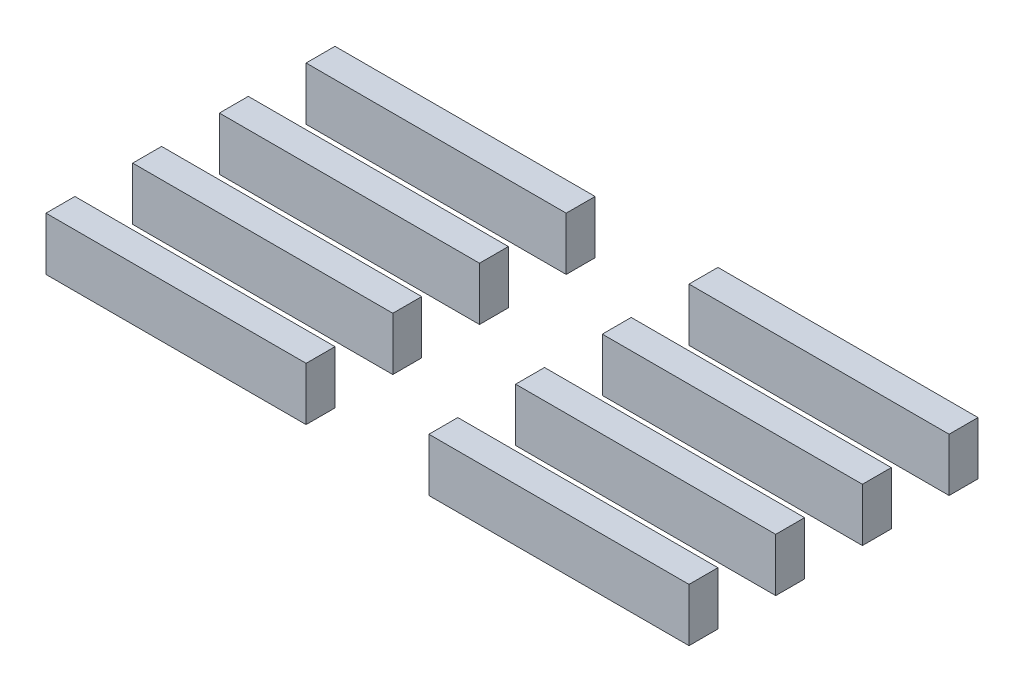
ISO-10303-21;
HEADER;
FILE_DESCRIPTION(('STEP AP214'),'2;1');
FILE_NAME('part.step','',(''),(''),'','','');
FILE_SCHEMA(('AUTOMOTIVE_DESIGN { 1 0 10303 214 1 1 1 1 }'));
ENDSEC;
DATA;
#1=APPLICATION_CONTEXT('core data for automotive mechanical design processes');
#2=APPLICATION_PROTOCOL_DEFINITION('international standard','automotive_design',2000,#1);
#3=PRODUCT_CONTEXT('',#1,'mechanical');
#4=PRODUCT('Part','Part','',(#3));
#5=PRODUCT_RELATED_PRODUCT_CATEGORY('part','',(#4));
#6=PRODUCT_DEFINITION_FORMATION('','',#4);
#7=PRODUCT_DEFINITION_CONTEXT('part definition',#1,'design');
#8=PRODUCT_DEFINITION('design','',#6,#7);
#9=PRODUCT_DEFINITION_SHAPE('','',#8);
#10=(LENGTH_UNIT() NAMED_UNIT(*) SI_UNIT(.MILLI.,.METRE.));
#11=(NAMED_UNIT(*) PLANE_ANGLE_UNIT() SI_UNIT($,.RADIAN.));
#12=(NAMED_UNIT(*) SI_UNIT($,.STERADIAN.) SOLID_ANGLE_UNIT());
#13=UNCERTAINTY_MEASURE_WITH_UNIT(LENGTH_MEASURE(1.E-05),#10,'distance_accuracy_value','');
#14=(GEOMETRIC_REPRESENTATION_CONTEXT(3) GLOBAL_UNCERTAINTY_ASSIGNED_CONTEXT((#13)) GLOBAL_UNIT_ASSIGNED_CONTEXT((#10,
#11,#12)) REPRESENTATION_CONTEXT('',''));
#15=CARTESIAN_POINT('',(0.,0.,0.));
#16=DIRECTION('',(0.,0.,1.));
#17=DIRECTION('',(1.,0.,0.));
#18=AXIS2_PLACEMENT_3D('',#15,#16,#17);
#19=CARTESIAN_POINT('',(59.4999999999999,7.35,-42.5));
#20=DIRECTION('',(1.,0.,0.));
#21=DIRECTION('',(0.,0.,-1.));
#22=AXIS2_PLACEMENT_3D('',#19,#20,#21);
#23=PLANE('',#22);
#24=DIRECTION('',(0.,0.,1.));
#25=VECTOR('',#24,1.);
#26=CARTESIAN_POINT('',(59.4999999999999,0.,-42.5));
#27=LINE('',#26,#25);
#28=CARTESIAN_POINT('',(59.4999999999999,0.,-46.5));
#29=VERTEX_POINT('',#28);
#30=CARTESIAN_POINT('',(59.4999999999999,0.,-42.5));
#31=VERTEX_POINT('',#30);
#32=EDGE_CURVE('E107',#29,#31,#27,.T.);
#33=ORIENTED_EDGE('',*,*,#32,.T.);
#34=DIRECTION('',(0.,-1.,0.));
#35=VECTOR('',#34,1.);
#36=CARTESIAN_POINT('',(59.4999999999999,7.35,-42.5));
#37=LINE('',#36,#35);
#38=CARTESIAN_POINT('',(59.4999999999999,7.35,-42.5));
#39=VERTEX_POINT('',#38);
#40=EDGE_CURVE('E12',#39,#31,#37,.T.);
#41=ORIENTED_EDGE('',*,*,#40,.F.);
#42=DIRECTION('',(0.,0.,1.));
#43=VECTOR('',#42,1.);
#44=CARTESIAN_POINT('',(59.4999999999999,7.35,-42.5));
#45=LINE('',#44,#43);
#46=CARTESIAN_POINT('',(59.4999999999999,7.35,-46.5));
#47=VERTEX_POINT('',#46);
#48=EDGE_CURVE('E95',#47,#39,#45,.T.);
#49=ORIENTED_EDGE('',*,*,#48,.F.);
#50=DIRECTION('',(0.,-1.,0.));
#51=VECTOR('',#50,1.);
#52=CARTESIAN_POINT('',(59.4999999999999,7.35,-46.5));
#53=LINE('',#52,#51);
#54=EDGE_CURVE('E103',#47,#29,#53,.T.);
#55=ORIENTED_EDGE('',*,*,#54,.T.);
#56=EDGE_LOOP('',(#33,#41,#49,#55));
#57=FACE_BOUND('',#56,.T.);
#58=ADVANCED_FACE('F44',(#57),#23,.F.);
#59=CARTESIAN_POINT('',(59.4999999999999,7.35,-42.5));
#60=DIRECTION('',(0.,0.,-1.));
#61=DIRECTION('',(-1.,0.,0.));
#62=AXIS2_PLACEMENT_3D('',#59,#60,#61);
#63=PLANE('',#62);
#64=DIRECTION('',(1.,0.,0.));
#65=VECTOR('',#64,1.);
#66=CARTESIAN_POINT('',(59.4999999999999,0.,-42.5));
#67=LINE('',#66,#65);
#68=CARTESIAN_POINT('',(95.4999999999999,0.,-42.5));
#69=VERTEX_POINT('',#68);
#70=EDGE_CURVE('E99',#31,#69,#67,.T.);
#71=ORIENTED_EDGE('',*,*,#70,.T.);
#72=DIRECTION('',(0.,-1.,0.));
#73=VECTOR('',#72,1.);
#74=CARTESIAN_POINT('',(95.4999999999999,7.35,-42.5));
#75=LINE('',#74,#73);
#76=CARTESIAN_POINT('',(95.4999999999999,7.35,-42.5));
#77=VERTEX_POINT('',#76);
#78=EDGE_CURVE('E52',#77,#69,#75,.T.);
#79=ORIENTED_EDGE('',*,*,#78,.F.);
#80=DIRECTION('',(1.,0.,0.));
#81=VECTOR('',#80,1.);
#82=CARTESIAN_POINT('',(59.4999999999999,7.35,-42.5));
#83=LINE('',#82,#81);
#84=EDGE_CURVE('E90',#39,#77,#83,.T.);
#85=ORIENTED_EDGE('',*,*,#84,.F.);
#86=ORIENTED_EDGE('',*,*,#40,.T.);
#87=EDGE_LOOP('',(#71,#79,#85,#86));
#88=FACE_BOUND('',#87,.T.);
#89=ADVANCED_FACE('F98',(#88),#63,.F.);
#90=CARTESIAN_POINT('',(95.4999999999999,7.35,-42.5));
#91=DIRECTION('',(-1.,0.,0.));
#92=DIRECTION('',(0.,0.,1.));
#93=AXIS2_PLACEMENT_3D('',#90,#91,#92);
#94=PLANE('',#93);
#95=DIRECTION('',(0.,0.,-1.));
#96=VECTOR('',#95,1.);
#97=CARTESIAN_POINT('',(95.4999999999999,0.,-42.5));
#98=LINE('',#97,#96);
#99=CARTESIAN_POINT('',(95.4999999999999,0.,-46.5));
#100=VERTEX_POINT('',#99);
#101=EDGE_CURVE('E77',#69,#100,#98,.T.);
#102=ORIENTED_EDGE('',*,*,#101,.T.);
#103=DIRECTION('',(0.,-1.,0.));
#104=VECTOR('',#103,1.);
#105=CARTESIAN_POINT('',(95.4999999999999,7.35,-46.5));
#106=LINE('',#105,#104);
#107=CARTESIAN_POINT('',(95.4999999999999,7.35,-46.5));
#108=VERTEX_POINT('',#107);
#109=EDGE_CURVE('E100',#108,#100,#106,.T.);
#110=ORIENTED_EDGE('',*,*,#109,.F.);
#111=DIRECTION('',(0.,0.,-1.));
#112=VECTOR('',#111,1.);
#113=CARTESIAN_POINT('',(95.4999999999999,7.35,-42.5));
#114=LINE('',#113,#112);
#115=EDGE_CURVE('E93',#77,#108,#114,.T.);
#116=ORIENTED_EDGE('',*,*,#115,.F.);
#117=ORIENTED_EDGE('',*,*,#78,.T.);
#118=EDGE_LOOP('',(#102,#110,#116,#117));
#119=FACE_BOUND('',#118,.T.);
#120=ADVANCED_FACE('F101',(#119),#94,.F.);
#121=CARTESIAN_POINT('',(59.4999999999999,7.35,-46.5));
#122=DIRECTION('',(0.,0.,1.));
#123=DIRECTION('',(1.,0.,0.));
#124=AXIS2_PLACEMENT_3D('',#121,#122,#123);
#125=PLANE('',#124);
#126=DIRECTION('',(-1.,0.,0.));
#127=VECTOR('',#126,1.);
#128=CARTESIAN_POINT('',(59.4999999999999,0.,-46.5));
#129=LINE('',#128,#127);
#130=EDGE_CURVE('E83',#100,#29,#129,.T.);
#131=ORIENTED_EDGE('',*,*,#130,.T.);
#132=ORIENTED_EDGE('',*,*,#54,.F.);
#133=DIRECTION('',(-1.,0.,0.));
#134=VECTOR('',#133,1.);
#135=CARTESIAN_POINT('',(59.4999999999999,7.35,-46.5));
#136=LINE('',#135,#134);
#137=EDGE_CURVE('E60',#108,#47,#136,.T.);
#138=ORIENTED_EDGE('',*,*,#137,.F.);
#139=ORIENTED_EDGE('',*,*,#109,.T.);
#140=EDGE_LOOP('',(#131,#132,#138,#139));
#141=FACE_BOUND('',#140,.T.);
#142=ADVANCED_FACE('F114',(#141),#125,.F.);
#143=CARTESIAN_POINT('',(59.4999999999999,7.35,-46.5));
#144=DIRECTION('',(0.,-1.,0.));
#145=DIRECTION('',(0.,0.,-1.));
#146=AXIS2_PLACEMENT_3D('',#143,#144,#145);
#147=PLANE('',#146);
#148=ORIENTED_EDGE('',*,*,#48,.T.);
#149=ORIENTED_EDGE('',*,*,#84,.T.);
#150=ORIENTED_EDGE('',*,*,#115,.T.);
#151=ORIENTED_EDGE('',*,*,#137,.T.);
#152=EDGE_LOOP('',(#148,#149,#150,#151));
#153=FACE_BOUND('',#152,.T.);
#154=ADVANCED_FACE('F91',(#153),#147,.F.);
#155=CARTESIAN_POINT('',(59.4999999999999,0.,-46.5));
#156=DIRECTION('',(0.,-1.,0.));
#157=DIRECTION('',(0.,0.,-1.));
#158=AXIS2_PLACEMENT_3D('',#155,#156,#157);
#159=PLANE('',#158);
#160=ORIENTED_EDGE('',*,*,#32,.F.);
#161=ORIENTED_EDGE('',*,*,#130,.F.);
#162=ORIENTED_EDGE('',*,*,#101,.F.);
#163=ORIENTED_EDGE('',*,*,#70,.F.);
#164=EDGE_LOOP('',(#160,#161,#162,#163));
#165=FACE_BOUND('',#164,.T.);
#166=ADVANCED_FACE('F117',(#165),#159,.T.);
#167=CLOSED_SHELL('',(#58,#89,#120,#142,#154,#166));
#168=MANIFOLD_SOLID_BREP('B2',#167);
#169=CARTESIAN_POINT('',(59.4999999999999,7.35,-30.5));
#170=DIRECTION('',(1.,0.,0.));
#171=DIRECTION('',(0.,0.,-1.));
#172=AXIS2_PLACEMENT_3D('',#169,#170,#171);
#173=PLANE('',#172);
#174=DIRECTION('',(0.,0.,1.));
#175=VECTOR('',#174,1.);
#176=CARTESIAN_POINT('',(59.4999999999999,0.,-30.5));
#177=LINE('',#176,#175);
#178=CARTESIAN_POINT('',(59.4999999999999,0.,-34.5));
#179=VERTEX_POINT('',#178);
#180=CARTESIAN_POINT('',(59.4999999999999,0.,-30.5));
#181=VERTEX_POINT('',#180);
#182=EDGE_CURVE('E241',#179,#181,#177,.T.);
#183=ORIENTED_EDGE('',*,*,#182,.T.);
#184=DIRECTION('',(0.,-1.,0.));
#185=VECTOR('',#184,1.);
#186=CARTESIAN_POINT('',(59.4999999999999,7.35,-30.5));
#187=LINE('',#186,#185);
#188=CARTESIAN_POINT('',(59.4999999999999,7.35,-30.5));
#189=VERTEX_POINT('',#188);
#190=EDGE_CURVE('E42',#189,#181,#187,.T.);
#191=ORIENTED_EDGE('',*,*,#190,.F.);
#192=DIRECTION('',(0.,0.,1.));
#193=VECTOR('',#192,1.);
#194=CARTESIAN_POINT('',(59.4999999999999,7.35,-30.5));
#195=LINE('',#194,#193);
#196=CARTESIAN_POINT('',(59.4999999999999,7.35,-34.5));
#197=VERTEX_POINT('',#196);
#198=EDGE_CURVE('E229',#197,#189,#195,.T.);
#199=ORIENTED_EDGE('',*,*,#198,.F.);
#200=DIRECTION('',(0.,-1.,0.));
#201=VECTOR('',#200,1.);
#202=CARTESIAN_POINT('',(59.4999999999999,7.35,-34.5));
#203=LINE('',#202,#201);
#204=EDGE_CURVE('E237',#197,#179,#203,.T.);
#205=ORIENTED_EDGE('',*,*,#204,.T.);
#206=EDGE_LOOP('',(#183,#191,#199,#205));
#207=FACE_BOUND('',#206,.T.);
#208=ADVANCED_FACE('F178',(#207),#173,.F.);
#209=CARTESIAN_POINT('',(59.4999999999999,7.35,-30.5));
#210=DIRECTION('',(0.,0.,-1.));
#211=DIRECTION('',(-1.,0.,0.));
#212=AXIS2_PLACEMENT_3D('',#209,#210,#211);
#213=PLANE('',#212);
#214=DIRECTION('',(1.,0.,0.));
#215=VECTOR('',#214,1.);
#216=CARTESIAN_POINT('',(59.4999999999999,0.,-30.5));
#217=LINE('',#216,#215);
#218=CARTESIAN_POINT('',(95.4999999999999,0.,-30.5));
#219=VERTEX_POINT('',#218);
#220=EDGE_CURVE('E233',#181,#219,#217,.T.);
#221=ORIENTED_EDGE('',*,*,#220,.T.);
#222=DIRECTION('',(0.,-1.,0.));
#223=VECTOR('',#222,1.);
#224=CARTESIAN_POINT('',(95.4999999999999,7.35,-30.5));
#225=LINE('',#224,#223);
#226=CARTESIAN_POINT('',(95.4999999999999,7.35,-30.5));
#227=VERTEX_POINT('',#226);
#228=EDGE_CURVE('E186',#227,#219,#225,.T.);
#229=ORIENTED_EDGE('',*,*,#228,.F.);
#230=DIRECTION('',(1.,0.,0.));
#231=VECTOR('',#230,1.);
#232=CARTESIAN_POINT('',(59.4999999999999,7.35,-30.5));
#233=LINE('',#232,#231);
#234=EDGE_CURVE('E224',#189,#227,#233,.T.);
#235=ORIENTED_EDGE('',*,*,#234,.F.);
#236=ORIENTED_EDGE('',*,*,#190,.T.);
#237=EDGE_LOOP('',(#221,#229,#235,#236));
#238=FACE_BOUND('',#237,.T.);
#239=ADVANCED_FACE('F232',(#238),#213,.F.);
#240=CARTESIAN_POINT('',(95.4999999999999,7.35,-30.5));
#241=DIRECTION('',(-1.,0.,0.));
#242=DIRECTION('',(0.,0.,1.));
#243=AXIS2_PLACEMENT_3D('',#240,#241,#242);
#244=PLANE('',#243);
#245=DIRECTION('',(0.,0.,-1.));
#246=VECTOR('',#245,1.);
#247=CARTESIAN_POINT('',(95.4999999999999,0.,-30.5));
#248=LINE('',#247,#246);
#249=CARTESIAN_POINT('',(95.4999999999999,0.,-34.5));
#250=VERTEX_POINT('',#249);
#251=EDGE_CURVE('E211',#219,#250,#248,.T.);
#252=ORIENTED_EDGE('',*,*,#251,.T.);
#253=DIRECTION('',(0.,-1.,0.));
#254=VECTOR('',#253,1.);
#255=CARTESIAN_POINT('',(95.4999999999999,7.35,-34.5));
#256=LINE('',#255,#254);
#257=CARTESIAN_POINT('',(95.4999999999999,7.35,-34.5));
#258=VERTEX_POINT('',#257);
#259=EDGE_CURVE('E234',#258,#250,#256,.T.);
#260=ORIENTED_EDGE('',*,*,#259,.F.);
#261=DIRECTION('',(0.,0.,-1.));
#262=VECTOR('',#261,1.);
#263=CARTESIAN_POINT('',(95.4999999999999,7.35,-30.5));
#264=LINE('',#263,#262);
#265=EDGE_CURVE('E227',#227,#258,#264,.T.);
#266=ORIENTED_EDGE('',*,*,#265,.F.);
#267=ORIENTED_EDGE('',*,*,#228,.T.);
#268=EDGE_LOOP('',(#252,#260,#266,#267));
#269=FACE_BOUND('',#268,.T.);
#270=ADVANCED_FACE('F235',(#269),#244,.F.);
#271=CARTESIAN_POINT('',(59.4999999999999,7.35,-34.5));
#272=DIRECTION('',(0.,0.,1.));
#273=DIRECTION('',(1.,0.,0.));
#274=AXIS2_PLACEMENT_3D('',#271,#272,#273);
#275=PLANE('',#274);
#276=DIRECTION('',(-1.,0.,0.));
#277=VECTOR('',#276,1.);
#278=CARTESIAN_POINT('',(59.4999999999999,0.,-34.5));
#279=LINE('',#278,#277);
#280=EDGE_CURVE('E217',#250,#179,#279,.T.);
#281=ORIENTED_EDGE('',*,*,#280,.T.);
#282=ORIENTED_EDGE('',*,*,#204,.F.);
#283=DIRECTION('',(-1.,0.,0.));
#284=VECTOR('',#283,1.);
#285=CARTESIAN_POINT('',(59.4999999999999,7.35,-34.5));
#286=LINE('',#285,#284);
#287=EDGE_CURVE('E194',#258,#197,#286,.T.);
#288=ORIENTED_EDGE('',*,*,#287,.F.);
#289=ORIENTED_EDGE('',*,*,#259,.T.);
#290=EDGE_LOOP('',(#281,#282,#288,#289));
#291=FACE_BOUND('',#290,.T.);
#292=ADVANCED_FACE('F248',(#291),#275,.F.);
#293=CARTESIAN_POINT('',(59.4999999999999,7.35,-34.5));
#294=DIRECTION('',(0.,-1.,0.));
#295=DIRECTION('',(0.,0.,-1.));
#296=AXIS2_PLACEMENT_3D('',#293,#294,#295);
#297=PLANE('',#296);
#298=ORIENTED_EDGE('',*,*,#198,.T.);
#299=ORIENTED_EDGE('',*,*,#234,.T.);
#300=ORIENTED_EDGE('',*,*,#265,.T.);
#301=ORIENTED_EDGE('',*,*,#287,.T.);
#302=EDGE_LOOP('',(#298,#299,#300,#301));
#303=FACE_BOUND('',#302,.T.);
#304=ADVANCED_FACE('F225',(#303),#297,.F.);
#305=CARTESIAN_POINT('',(59.4999999999999,0.,-34.5));
#306=DIRECTION('',(0.,-1.,0.));
#307=DIRECTION('',(0.,0.,-1.));
#308=AXIS2_PLACEMENT_3D('',#305,#306,#307);
#309=PLANE('',#308);
#310=ORIENTED_EDGE('',*,*,#182,.F.);
#311=ORIENTED_EDGE('',*,*,#280,.F.);
#312=ORIENTED_EDGE('',*,*,#251,.F.);
#313=ORIENTED_EDGE('',*,*,#220,.F.);
#314=EDGE_LOOP('',(#310,#311,#312,#313));
#315=FACE_BOUND('',#314,.T.);
#316=ADVANCED_FACE('F251',(#315),#309,.T.);
#317=CLOSED_SHELL('',(#208,#239,#270,#292,#304,#316));
#318=MANIFOLD_SOLID_BREP('B6',#317);
#319=CARTESIAN_POINT('',(59.5,7.35,-18.5));
#320=DIRECTION('',(1.,0.,0.));
#321=DIRECTION('',(0.,0.,-1.));
#322=AXIS2_PLACEMENT_3D('',#319,#320,#321);
#323=PLANE('',#322);
#324=DIRECTION('',(0.,0.,1.));
#325=VECTOR('',#324,1.);
#326=CARTESIAN_POINT('',(59.5,0.,-18.5));
#327=LINE('',#326,#325);
#328=CARTESIAN_POINT('',(59.5,0.,-22.5));
#329=VERTEX_POINT('',#328);
#330=CARTESIAN_POINT('',(59.5,0.,-18.5));
#331=VERTEX_POINT('',#330);
#332=EDGE_CURVE('E375',#329,#331,#327,.T.);
#333=ORIENTED_EDGE('',*,*,#332,.T.);
#334=DIRECTION('',(0.,-1.,0.));
#335=VECTOR('',#334,1.);
#336=CARTESIAN_POINT('',(59.5,7.35,-18.5));
#337=LINE('',#336,#335);
#338=CARTESIAN_POINT('',(59.5,7.35,-18.5));
#339=VERTEX_POINT('',#338);
#340=EDGE_CURVE('E176',#339,#331,#337,.T.);
#341=ORIENTED_EDGE('',*,*,#340,.F.);
#342=DIRECTION('',(0.,0.,1.));
#343=VECTOR('',#342,1.);
#344=CARTESIAN_POINT('',(59.5,7.35,-18.5));
#345=LINE('',#344,#343);
#346=CARTESIAN_POINT('',(59.5,7.35,-22.5));
#347=VERTEX_POINT('',#346);
#348=EDGE_CURVE('E363',#347,#339,#345,.T.);
#349=ORIENTED_EDGE('',*,*,#348,.F.);
#350=DIRECTION('',(0.,-1.,0.));
#351=VECTOR('',#350,1.);
#352=CARTESIAN_POINT('',(59.5,7.35,-22.5));
#353=LINE('',#352,#351);
#354=EDGE_CURVE('E371',#347,#329,#353,.T.);
#355=ORIENTED_EDGE('',*,*,#354,.T.);
#356=EDGE_LOOP('',(#333,#341,#349,#355));
#357=FACE_BOUND('',#356,.T.);
#358=ADVANCED_FACE('F312',(#357),#323,.F.);
#359=CARTESIAN_POINT('',(59.5,7.35,-18.5));
#360=DIRECTION('',(0.,0.,-1.));
#361=DIRECTION('',(-1.,0.,0.));
#362=AXIS2_PLACEMENT_3D('',#359,#360,#361);
#363=PLANE('',#362);
#364=DIRECTION('',(1.,0.,0.));
#365=VECTOR('',#364,1.);
#366=CARTESIAN_POINT('',(59.5,0.,-18.5));
#367=LINE('',#366,#365);
#368=CARTESIAN_POINT('',(95.5,0.,-18.5));
#369=VERTEX_POINT('',#368);
#370=EDGE_CURVE('E367',#331,#369,#367,.T.);
#371=ORIENTED_EDGE('',*,*,#370,.T.);
#372=DIRECTION('',(0.,-1.,0.));
#373=VECTOR('',#372,1.);
#374=CARTESIAN_POINT('',(95.5,7.35,-18.5));
#375=LINE('',#374,#373);
#376=CARTESIAN_POINT('',(95.5,7.35,-18.5));
#377=VERTEX_POINT('',#376);
#378=EDGE_CURVE('E320',#377,#369,#375,.T.);
#379=ORIENTED_EDGE('',*,*,#378,.F.);
#380=DIRECTION('',(1.,0.,0.));
#381=VECTOR('',#380,1.);
#382=CARTESIAN_POINT('',(59.5,7.35,-18.5));
#383=LINE('',#382,#381);
#384=EDGE_CURVE('E358',#339,#377,#383,.T.);
#385=ORIENTED_EDGE('',*,*,#384,.F.);
#386=ORIENTED_EDGE('',*,*,#340,.T.);
#387=EDGE_LOOP('',(#371,#379,#385,#386));
#388=FACE_BOUND('',#387,.T.);
#389=ADVANCED_FACE('F366',(#388),#363,.F.);
#390=CARTESIAN_POINT('',(95.5,7.35,-18.5));
#391=DIRECTION('',(-1.,0.,0.));
#392=DIRECTION('',(0.,0.,1.));
#393=AXIS2_PLACEMENT_3D('',#390,#391,#392);
#394=PLANE('',#393);
#395=DIRECTION('',(0.,0.,-1.));
#396=VECTOR('',#395,1.);
#397=CARTESIAN_POINT('',(95.5,0.,-18.5));
#398=LINE('',#397,#396);
#399=CARTESIAN_POINT('',(95.5,0.,-22.5));
#400=VERTEX_POINT('',#399);
#401=EDGE_CURVE('E345',#369,#400,#398,.T.);
#402=ORIENTED_EDGE('',*,*,#401,.T.);
#403=DIRECTION('',(0.,-1.,0.));
#404=VECTOR('',#403,1.);
#405=CARTESIAN_POINT('',(95.5,7.35,-22.5));
#406=LINE('',#405,#404);
#407=CARTESIAN_POINT('',(95.5,7.35,-22.5));
#408=VERTEX_POINT('',#407);
#409=EDGE_CURVE('E368',#408,#400,#406,.T.);
#410=ORIENTED_EDGE('',*,*,#409,.F.);
#411=DIRECTION('',(0.,0.,-1.));
#412=VECTOR('',#411,1.);
#413=CARTESIAN_POINT('',(95.5,7.35,-18.5));
#414=LINE('',#413,#412);
#415=EDGE_CURVE('E361',#377,#408,#414,.T.);
#416=ORIENTED_EDGE('',*,*,#415,.F.);
#417=ORIENTED_EDGE('',*,*,#378,.T.);
#418=EDGE_LOOP('',(#402,#410,#416,#417));
#419=FACE_BOUND('',#418,.T.);
#420=ADVANCED_FACE('F369',(#419),#394,.F.);
#421=CARTESIAN_POINT('',(59.5,7.35,-22.5));
#422=DIRECTION('',(0.,0.,1.));
#423=DIRECTION('',(1.,0.,0.));
#424=AXIS2_PLACEMENT_3D('',#421,#422,#423);
#425=PLANE('',#424);
#426=DIRECTION('',(-1.,0.,0.));
#427=VECTOR('',#426,1.);
#428=CARTESIAN_POINT('',(59.5,0.,-22.5));
#429=LINE('',#428,#427);
#430=EDGE_CURVE('E351',#400,#329,#429,.T.);
#431=ORIENTED_EDGE('',*,*,#430,.T.);
#432=ORIENTED_EDGE('',*,*,#354,.F.);
#433=DIRECTION('',(-1.,0.,0.));
#434=VECTOR('',#433,1.);
#435=CARTESIAN_POINT('',(59.5,7.35,-22.5));
#436=LINE('',#435,#434);
#437=EDGE_CURVE('E328',#408,#347,#436,.T.);
#438=ORIENTED_EDGE('',*,*,#437,.F.);
#439=ORIENTED_EDGE('',*,*,#409,.T.);
#440=EDGE_LOOP('',(#431,#432,#438,#439));
#441=FACE_BOUND('',#440,.T.);
#442=ADVANCED_FACE('F382',(#441),#425,.F.);
#443=CARTESIAN_POINT('',(59.5,7.35,-22.5));
#444=DIRECTION('',(0.,-1.,0.));
#445=DIRECTION('',(0.,0.,-1.));
#446=AXIS2_PLACEMENT_3D('',#443,#444,#445);
#447=PLANE('',#446);
#448=ORIENTED_EDGE('',*,*,#348,.T.);
#449=ORIENTED_EDGE('',*,*,#384,.T.);
#450=ORIENTED_EDGE('',*,*,#415,.T.);
#451=ORIENTED_EDGE('',*,*,#437,.T.);
#452=EDGE_LOOP('',(#448,#449,#450,#451));
#453=FACE_BOUND('',#452,.T.);
#454=ADVANCED_FACE('F359',(#453),#447,.F.);
#455=CARTESIAN_POINT('',(59.5,0.,-22.5));
#456=DIRECTION('',(0.,-1.,0.));
#457=DIRECTION('',(0.,0.,-1.));
#458=AXIS2_PLACEMENT_3D('',#455,#456,#457);
#459=PLANE('',#458);
#460=ORIENTED_EDGE('',*,*,#332,.F.);
#461=ORIENTED_EDGE('',*,*,#430,.F.);
#462=ORIENTED_EDGE('',*,*,#401,.F.);
#463=ORIENTED_EDGE('',*,*,#370,.F.);
#464=EDGE_LOOP('',(#460,#461,#462,#463));
#465=FACE_BOUND('',#464,.T.);
#466=ADVANCED_FACE('F385',(#465),#459,.T.);
#467=CLOSED_SHELL('',(#358,#389,#420,#442,#454,#466));
#468=MANIFOLD_SOLID_BREP('B36',#467);
#469=CARTESIAN_POINT('',(59.5,7.35,-6.5));
#470=DIRECTION('',(1.,0.,0.));
#471=DIRECTION('',(0.,0.,-1.));
#472=AXIS2_PLACEMENT_3D('',#469,#470,#471);
#473=PLANE('',#472);
#474=DIRECTION('',(0.,0.,1.));
#475=VECTOR('',#474,1.);
#476=CARTESIAN_POINT('',(59.5,0.,-6.5));
#477=LINE('',#476,#475);
#478=CARTESIAN_POINT('',(59.5,0.,-10.5));
#479=VERTEX_POINT('',#478);
#480=CARTESIAN_POINT('',(59.5,0.,-6.5));
#481=VERTEX_POINT('',#480);
#482=EDGE_CURVE('E509',#479,#481,#477,.T.);
#483=ORIENTED_EDGE('',*,*,#482,.T.);
#484=DIRECTION('',(0.,-1.,0.));
#485=VECTOR('',#484,1.);
#486=CARTESIAN_POINT('',(59.5,7.35,-6.5));
#487=LINE('',#486,#485);
#488=CARTESIAN_POINT('',(59.5,7.35,-6.5));
#489=VERTEX_POINT('',#488);
#490=EDGE_CURVE('E310',#489,#481,#487,.T.);
#491=ORIENTED_EDGE('',*,*,#490,.F.);
#492=DIRECTION('',(0.,0.,1.));
#493=VECTOR('',#492,1.);
#494=CARTESIAN_POINT('',(59.5,7.35,-6.5));
#495=LINE('',#494,#493);
#496=CARTESIAN_POINT('',(59.5,7.35,-10.5));
#497=VERTEX_POINT('',#496);
#498=EDGE_CURVE('E497',#497,#489,#495,.T.);
#499=ORIENTED_EDGE('',*,*,#498,.F.);
#500=DIRECTION('',(0.,-1.,0.));
#501=VECTOR('',#500,1.);
#502=CARTESIAN_POINT('',(59.5,7.35,-10.5));
#503=LINE('',#502,#501);
#504=EDGE_CURVE('E505',#497,#479,#503,.T.);
#505=ORIENTED_EDGE('',*,*,#504,.T.);
#506=EDGE_LOOP('',(#483,#491,#499,#505));
#507=FACE_BOUND('',#506,.T.);
#508=ADVANCED_FACE('F446',(#507),#473,.F.);
#509=CARTESIAN_POINT('',(59.5,7.35,-6.5));
#510=DIRECTION('',(0.,0.,-1.));
#511=DIRECTION('',(-1.,0.,0.));
#512=AXIS2_PLACEMENT_3D('',#509,#510,#511);
#513=PLANE('',#512);
#514=DIRECTION('',(1.,0.,0.));
#515=VECTOR('',#514,1.);
#516=CARTESIAN_POINT('',(59.5,0.,-6.5));
#517=LINE('',#516,#515);
#518=CARTESIAN_POINT('',(95.5,0.,-6.5));
#519=VERTEX_POINT('',#518);
#520=EDGE_CURVE('E501',#481,#519,#517,.T.);
#521=ORIENTED_EDGE('',*,*,#520,.T.);
#522=DIRECTION('',(0.,-1.,0.));
#523=VECTOR('',#522,1.);
#524=CARTESIAN_POINT('',(95.5,7.35,-6.5));
#525=LINE('',#524,#523);
#526=CARTESIAN_POINT('',(95.5,7.35,-6.5));
#527=VERTEX_POINT('',#526);
#528=EDGE_CURVE('E454',#527,#519,#525,.T.);
#529=ORIENTED_EDGE('',*,*,#528,.F.);
#530=DIRECTION('',(1.,0.,0.));
#531=VECTOR('',#530,1.);
#532=CARTESIAN_POINT('',(59.5,7.35,-6.5));
#533=LINE('',#532,#531);
#534=EDGE_CURVE('E492',#489,#527,#533,.T.);
#535=ORIENTED_EDGE('',*,*,#534,.F.);
#536=ORIENTED_EDGE('',*,*,#490,.T.);
#537=EDGE_LOOP('',(#521,#529,#535,#536));
#538=FACE_BOUND('',#537,.T.);
#539=ADVANCED_FACE('F500',(#538),#513,.F.);
#540=CARTESIAN_POINT('',(95.5,7.35,-6.5));
#541=DIRECTION('',(-1.,0.,0.));
#542=DIRECTION('',(0.,0.,1.));
#543=AXIS2_PLACEMENT_3D('',#540,#541,#542);
#544=PLANE('',#543);
#545=DIRECTION('',(0.,0.,-1.));
#546=VECTOR('',#545,1.);
#547=CARTESIAN_POINT('',(95.5,0.,-6.5));
#548=LINE('',#547,#546);
#549=CARTESIAN_POINT('',(95.5,0.,-10.5));
#550=VERTEX_POINT('',#549);
#551=EDGE_CURVE('E479',#519,#550,#548,.T.);
#552=ORIENTED_EDGE('',*,*,#551,.T.);
#553=DIRECTION('',(0.,-1.,0.));
#554=VECTOR('',#553,1.);
#555=CARTESIAN_POINT('',(95.5,7.35,-10.5));
#556=LINE('',#555,#554);
#557=CARTESIAN_POINT('',(95.5,7.35,-10.5));
#558=VERTEX_POINT('',#557);
#559=EDGE_CURVE('E502',#558,#550,#556,.T.);
#560=ORIENTED_EDGE('',*,*,#559,.F.);
#561=DIRECTION('',(0.,0.,-1.));
#562=VECTOR('',#561,1.);
#563=CARTESIAN_POINT('',(95.5,7.35,-6.5));
#564=LINE('',#563,#562);
#565=EDGE_CURVE('E495',#527,#558,#564,.T.);
#566=ORIENTED_EDGE('',*,*,#565,.F.);
#567=ORIENTED_EDGE('',*,*,#528,.T.);
#568=EDGE_LOOP('',(#552,#560,#566,#567));
#569=FACE_BOUND('',#568,.T.);
#570=ADVANCED_FACE('F503',(#569),#544,.F.);
#571=CARTESIAN_POINT('',(59.5,7.35,-10.5));
#572=DIRECTION('',(0.,0.,1.));
#573=DIRECTION('',(1.,0.,0.));
#574=AXIS2_PLACEMENT_3D('',#571,#572,#573);
#575=PLANE('',#574);
#576=DIRECTION('',(-1.,0.,0.));
#577=VECTOR('',#576,1.);
#578=CARTESIAN_POINT('',(59.5,0.,-10.5));
#579=LINE('',#578,#577);
#580=EDGE_CURVE('E485',#550,#479,#579,.T.);
#581=ORIENTED_EDGE('',*,*,#580,.T.);
#582=ORIENTED_EDGE('',*,*,#504,.F.);
#583=DIRECTION('',(-1.,0.,0.));
#584=VECTOR('',#583,1.);
#585=CARTESIAN_POINT('',(59.5,7.35,-10.5));
#586=LINE('',#585,#584);
#587=EDGE_CURVE('E462',#558,#497,#586,.T.);
#588=ORIENTED_EDGE('',*,*,#587,.F.);
#589=ORIENTED_EDGE('',*,*,#559,.T.);
#590=EDGE_LOOP('',(#581,#582,#588,#589));
#591=FACE_BOUND('',#590,.T.);
#592=ADVANCED_FACE('F516',(#591),#575,.F.);
#593=CARTESIAN_POINT('',(59.5,7.35,-10.5));
#594=DIRECTION('',(0.,-1.,0.));
#595=DIRECTION('',(0.,0.,-1.));
#596=AXIS2_PLACEMENT_3D('',#593,#594,#595);
#597=PLANE('',#596);
#598=ORIENTED_EDGE('',*,*,#498,.T.);
#599=ORIENTED_EDGE('',*,*,#534,.T.);
#600=ORIENTED_EDGE('',*,*,#565,.T.);
#601=ORIENTED_EDGE('',*,*,#587,.T.);
#602=EDGE_LOOP('',(#598,#599,#600,#601));
#603=FACE_BOUND('',#602,.T.);
#604=ADVANCED_FACE('F493',(#603),#597,.F.);
#605=CARTESIAN_POINT('',(59.5,0.,-10.5));
#606=DIRECTION('',(0.,-1.,0.));
#607=DIRECTION('',(0.,0.,-1.));
#608=AXIS2_PLACEMENT_3D('',#605,#606,#607);
#609=PLANE('',#608);
#610=ORIENTED_EDGE('',*,*,#482,.F.);
#611=ORIENTED_EDGE('',*,*,#580,.F.);
#612=ORIENTED_EDGE('',*,*,#551,.F.);
#613=ORIENTED_EDGE('',*,*,#520,.F.);
#614=EDGE_LOOP('',(#610,#611,#612,#613));
#615=FACE_BOUND('',#614,.T.);
#616=ADVANCED_FACE('F519',(#615),#609,.T.);
#617=CLOSED_SHELL('',(#508,#539,#570,#592,#604,#616));
#618=MANIFOLD_SOLID_BREP('B170',#617);
#619=CARTESIAN_POINT('',(6.49999999999987,7.35,-42.5));
#620=DIRECTION('',(1.,0.,0.));
#621=DIRECTION('',(0.,0.,-1.));
#622=AXIS2_PLACEMENT_3D('',#619,#620,#621);
#623=PLANE('',#622);
#624=DIRECTION('',(0.,0.,1.));
#625=VECTOR('',#624,1.);
#626=CARTESIAN_POINT('',(6.49999999999987,0.,-42.5));
#627=LINE('',#626,#625);
#628=CARTESIAN_POINT('',(6.49999999999987,0.,-46.5));
#629=VERTEX_POINT('',#628);
#630=CARTESIAN_POINT('',(6.49999999999987,0.,-42.5));
#631=VERTEX_POINT('',#630);
#632=EDGE_CURVE('E643',#629,#631,#627,.T.);
#633=ORIENTED_EDGE('',*,*,#632,.T.);
#634=DIRECTION('',(0.,-1.,0.));
#635=VECTOR('',#634,1.);
#636=CARTESIAN_POINT('',(6.49999999999987,7.35,-42.5));
#637=LINE('',#636,#635);
#638=CARTESIAN_POINT('',(6.49999999999987,7.35,-42.5));
#639=VERTEX_POINT('',#638);
#640=EDGE_CURVE('E444',#639,#631,#637,.T.);
#641=ORIENTED_EDGE('',*,*,#640,.F.);
#642=DIRECTION('',(0.,0.,1.));
#643=VECTOR('',#642,1.);
#644=CARTESIAN_POINT('',(6.49999999999987,7.35,-42.5));
#645=LINE('',#644,#643);
#646=CARTESIAN_POINT('',(6.49999999999987,7.35,-46.5));
#647=VERTEX_POINT('',#646);
#648=EDGE_CURVE('E631',#647,#639,#645,.T.);
#649=ORIENTED_EDGE('',*,*,#648,.F.);
#650=DIRECTION('',(0.,-1.,0.));
#651=VECTOR('',#650,1.);
#652=CARTESIAN_POINT('',(6.49999999999987,7.35,-46.5));
#653=LINE('',#652,#651);
#654=EDGE_CURVE('E639',#647,#629,#653,.T.);
#655=ORIENTED_EDGE('',*,*,#654,.T.);
#656=EDGE_LOOP('',(#633,#641,#649,#655));
#657=FACE_BOUND('',#656,.T.);
#658=ADVANCED_FACE('F580',(#657),#623,.F.);
#659=CARTESIAN_POINT('',(6.49999999999987,7.35,-42.5));
#660=DIRECTION('',(0.,0.,-1.));
#661=DIRECTION('',(-1.,0.,0.));
#662=AXIS2_PLACEMENT_3D('',#659,#660,#661);
#663=PLANE('',#662);
#664=DIRECTION('',(1.,0.,0.));
#665=VECTOR('',#664,1.);
#666=CARTESIAN_POINT('',(6.49999999999987,0.,-42.5));
#667=LINE('',#666,#665);
#668=CARTESIAN_POINT('',(42.4999999999999,0.,-42.5));
#669=VERTEX_POINT('',#668);
#670=EDGE_CURVE('E635',#631,#669,#667,.T.);
#671=ORIENTED_EDGE('',*,*,#670,.T.);
#672=DIRECTION('',(0.,-1.,0.));
#673=VECTOR('',#672,1.);
#674=CARTESIAN_POINT('',(42.4999999999999,7.35,-42.5));
#675=LINE('',#674,#673);
#676=CARTESIAN_POINT('',(42.4999999999999,7.35,-42.5));
#677=VERTEX_POINT('',#676);
#678=EDGE_CURVE('E588',#677,#669,#675,.T.);
#679=ORIENTED_EDGE('',*,*,#678,.F.);
#680=DIRECTION('',(1.,0.,0.));
#681=VECTOR('',#680,1.);
#682=CARTESIAN_POINT('',(6.49999999999987,7.35,-42.5));
#683=LINE('',#682,#681);
#684=EDGE_CURVE('E626',#639,#677,#683,.T.);
#685=ORIENTED_EDGE('',*,*,#684,.F.);
#686=ORIENTED_EDGE('',*,*,#640,.T.);
#687=EDGE_LOOP('',(#671,#679,#685,#686));
#688=FACE_BOUND('',#687,.T.);
#689=ADVANCED_FACE('F634',(#688),#663,.F.);
#690=CARTESIAN_POINT('',(42.4999999999999,7.35,-42.5));
#691=DIRECTION('',(-1.,0.,0.));
#692=DIRECTION('',(0.,0.,1.));
#693=AXIS2_PLACEMENT_3D('',#690,#691,#692);
#694=PLANE('',#693);
#695=DIRECTION('',(0.,0.,-1.));
#696=VECTOR('',#695,1.);
#697=CARTESIAN_POINT('',(42.4999999999999,0.,-42.5));
#698=LINE('',#697,#696);
#699=CARTESIAN_POINT('',(42.4999999999999,0.,-46.5));
#700=VERTEX_POINT('',#699);
#701=EDGE_CURVE('E613',#669,#700,#698,.T.);
#702=ORIENTED_EDGE('',*,*,#701,.T.);
#703=DIRECTION('',(0.,-1.,0.));
#704=VECTOR('',#703,1.);
#705=CARTESIAN_POINT('',(42.4999999999999,7.35,-46.5));
#706=LINE('',#705,#704);
#707=CARTESIAN_POINT('',(42.4999999999999,7.35,-46.5));
#708=VERTEX_POINT('',#707);
#709=EDGE_CURVE('E636',#708,#700,#706,.T.);
#710=ORIENTED_EDGE('',*,*,#709,.F.);
#711=DIRECTION('',(0.,0.,-1.));
#712=VECTOR('',#711,1.);
#713=CARTESIAN_POINT('',(42.4999999999999,7.35,-42.5));
#714=LINE('',#713,#712);
#715=EDGE_CURVE('E629',#677,#708,#714,.T.);
#716=ORIENTED_EDGE('',*,*,#715,.F.);
#717=ORIENTED_EDGE('',*,*,#678,.T.);
#718=EDGE_LOOP('',(#702,#710,#716,#717));
#719=FACE_BOUND('',#718,.T.);
#720=ADVANCED_FACE('F637',(#719),#694,.F.);
#721=CARTESIAN_POINT('',(6.49999999999987,7.35,-46.5));
#722=DIRECTION('',(0.,0.,1.));
#723=DIRECTION('',(1.,0.,0.));
#724=AXIS2_PLACEMENT_3D('',#721,#722,#723);
#725=PLANE('',#724);
#726=DIRECTION('',(-1.,0.,0.));
#727=VECTOR('',#726,1.);
#728=CARTESIAN_POINT('',(6.49999999999987,0.,-46.5));
#729=LINE('',#728,#727);
#730=EDGE_CURVE('E619',#700,#629,#729,.T.);
#731=ORIENTED_EDGE('',*,*,#730,.T.);
#732=ORIENTED_EDGE('',*,*,#654,.F.);
#733=DIRECTION('',(-1.,0.,0.));
#734=VECTOR('',#733,1.);
#735=CARTESIAN_POINT('',(6.49999999999987,7.35,-46.5));
#736=LINE('',#735,#734);
#737=EDGE_CURVE('E596',#708,#647,#736,.T.);
#738=ORIENTED_EDGE('',*,*,#737,.F.);
#739=ORIENTED_EDGE('',*,*,#709,.T.);
#740=EDGE_LOOP('',(#731,#732,#738,#739));
#741=FACE_BOUND('',#740,.T.);
#742=ADVANCED_FACE('F650',(#741),#725,.F.);
#743=CARTESIAN_POINT('',(6.49999999999987,7.35,-46.5));
#744=DIRECTION('',(0.,-1.,0.));
#745=DIRECTION('',(0.,0.,-1.));
#746=AXIS2_PLACEMENT_3D('',#743,#744,#745);
#747=PLANE('',#746);
#748=ORIENTED_EDGE('',*,*,#648,.T.);
#749=ORIENTED_EDGE('',*,*,#684,.T.);
#750=ORIENTED_EDGE('',*,*,#715,.T.);
#751=ORIENTED_EDGE('',*,*,#737,.T.);
#752=EDGE_LOOP('',(#748,#749,#750,#751));
#753=FACE_BOUND('',#752,.T.);
#754=ADVANCED_FACE('F627',(#753),#747,.F.);
#755=CARTESIAN_POINT('',(6.49999999999987,0.,-46.5));
#756=DIRECTION('',(0.,-1.,0.));
#757=DIRECTION('',(0.,0.,-1.));
#758=AXIS2_PLACEMENT_3D('',#755,#756,#757);
#759=PLANE('',#758);
#760=ORIENTED_EDGE('',*,*,#632,.F.);
#761=ORIENTED_EDGE('',*,*,#730,.F.);
#762=ORIENTED_EDGE('',*,*,#701,.F.);
#763=ORIENTED_EDGE('',*,*,#670,.F.);
#764=EDGE_LOOP('',(#760,#761,#762,#763));
#765=FACE_BOUND('',#764,.T.);
#766=ADVANCED_FACE('F653',(#765),#759,.T.);
#767=CLOSED_SHELL('',(#658,#689,#720,#742,#754,#766));
#768=MANIFOLD_SOLID_BREP('B304',#767);
#769=CARTESIAN_POINT('',(6.49999999999992,7.35,-30.5));
#770=DIRECTION('',(1.,0.,0.));
#771=DIRECTION('',(0.,0.,-1.));
#772=AXIS2_PLACEMENT_3D('',#769,#770,#771);
#773=PLANE('',#772);
#774=DIRECTION('',(0.,0.,1.));
#775=VECTOR('',#774,1.);
#776=CARTESIAN_POINT('',(6.49999999999992,0.,-30.5));
#777=LINE('',#776,#775);
#778=CARTESIAN_POINT('',(6.49999999999992,0.,-34.5));
#779=VERTEX_POINT('',#778);
#780=CARTESIAN_POINT('',(6.49999999999992,0.,-30.5));
#781=VERTEX_POINT('',#780);
#782=EDGE_CURVE('E777',#779,#781,#777,.T.);
#783=ORIENTED_EDGE('',*,*,#782,.T.);
#784=DIRECTION('',(0.,-1.,0.));
#785=VECTOR('',#784,1.);
#786=CARTESIAN_POINT('',(6.49999999999992,7.35,-30.5));
#787=LINE('',#786,#785);
#788=CARTESIAN_POINT('',(6.49999999999992,7.35,-30.5));
#789=VERTEX_POINT('',#788);
#790=EDGE_CURVE('E578',#789,#781,#787,.T.);
#791=ORIENTED_EDGE('',*,*,#790,.F.);
#792=DIRECTION('',(0.,0.,1.));
#793=VECTOR('',#792,1.);
#794=CARTESIAN_POINT('',(6.49999999999992,7.35,-30.5));
#795=LINE('',#794,#793);
#796=CARTESIAN_POINT('',(6.49999999999992,7.35,-34.5));
#797=VERTEX_POINT('',#796);
#798=EDGE_CURVE('E765',#797,#789,#795,.T.);
#799=ORIENTED_EDGE('',*,*,#798,.F.);
#800=DIRECTION('',(0.,-1.,0.));
#801=VECTOR('',#800,1.);
#802=CARTESIAN_POINT('',(6.49999999999992,7.35,-34.5));
#803=LINE('',#802,#801);
#804=EDGE_CURVE('E773',#797,#779,#803,.T.);
#805=ORIENTED_EDGE('',*,*,#804,.T.);
#806=EDGE_LOOP('',(#783,#791,#799,#805));
#807=FACE_BOUND('',#806,.T.);
#808=ADVANCED_FACE('F714',(#807),#773,.F.);
#809=CARTESIAN_POINT('',(6.49999999999992,7.35,-30.5));
#810=DIRECTION('',(0.,0.,-1.));
#811=DIRECTION('',(-1.,0.,0.));
#812=AXIS2_PLACEMENT_3D('',#809,#810,#811);
#813=PLANE('',#812);
#814=DIRECTION('',(1.,0.,0.));
#815=VECTOR('',#814,1.);
#816=CARTESIAN_POINT('',(6.49999999999992,0.,-30.5));
#817=LINE('',#816,#815);
#818=CARTESIAN_POINT('',(42.4999999999999,0.,-30.5));
#819=VERTEX_POINT('',#818);
#820=EDGE_CURVE('E769',#781,#819,#817,.T.);
#821=ORIENTED_EDGE('',*,*,#820,.T.);
#822=DIRECTION('',(0.,-1.,0.));
#823=VECTOR('',#822,1.);
#824=CARTESIAN_POINT('',(42.4999999999999,7.35,-30.5));
#825=LINE('',#824,#823);
#826=CARTESIAN_POINT('',(42.4999999999999,7.35,-30.5));
#827=VERTEX_POINT('',#826);
#828=EDGE_CURVE('E722',#827,#819,#825,.T.);
#829=ORIENTED_EDGE('',*,*,#828,.F.);
#830=DIRECTION('',(1.,0.,0.));
#831=VECTOR('',#830,1.);
#832=CARTESIAN_POINT('',(6.49999999999992,7.35,-30.5));
#833=LINE('',#832,#831);
#834=EDGE_CURVE('E760',#789,#827,#833,.T.);
#835=ORIENTED_EDGE('',*,*,#834,.F.);
#836=ORIENTED_EDGE('',*,*,#790,.T.);
#837=EDGE_LOOP('',(#821,#829,#835,#836));
#838=FACE_BOUND('',#837,.T.);
#839=ADVANCED_FACE('F768',(#838),#813,.F.);
#840=CARTESIAN_POINT('',(42.4999999999999,7.35,-30.5));
#841=DIRECTION('',(-1.,0.,0.));
#842=DIRECTION('',(0.,0.,1.));
#843=AXIS2_PLACEMENT_3D('',#840,#841,#842);
#844=PLANE('',#843);
#845=DIRECTION('',(0.,0.,-1.));
#846=VECTOR('',#845,1.);
#847=CARTESIAN_POINT('',(42.4999999999999,0.,-30.5));
#848=LINE('',#847,#846);
#849=CARTESIAN_POINT('',(42.4999999999999,0.,-34.5));
#850=VERTEX_POINT('',#849);
#851=EDGE_CURVE('E747',#819,#850,#848,.T.);
#852=ORIENTED_EDGE('',*,*,#851,.T.);
#853=DIRECTION('',(0.,-1.,0.));
#854=VECTOR('',#853,1.);
#855=CARTESIAN_POINT('',(42.4999999999999,7.35,-34.5));
#856=LINE('',#855,#854);
#857=CARTESIAN_POINT('',(42.4999999999999,7.35,-34.5));
#858=VERTEX_POINT('',#857);
#859=EDGE_CURVE('E770',#858,#850,#856,.T.);
#860=ORIENTED_EDGE('',*,*,#859,.F.);
#861=DIRECTION('',(0.,0.,-1.));
#862=VECTOR('',#861,1.);
#863=CARTESIAN_POINT('',(42.4999999999999,7.35,-30.5));
#864=LINE('',#863,#862);
#865=EDGE_CURVE('E763',#827,#858,#864,.T.);
#866=ORIENTED_EDGE('',*,*,#865,.F.);
#867=ORIENTED_EDGE('',*,*,#828,.T.);
#868=EDGE_LOOP('',(#852,#860,#866,#867));
#869=FACE_BOUND('',#868,.T.);
#870=ADVANCED_FACE('F771',(#869),#844,.F.);
#871=CARTESIAN_POINT('',(6.49999999999992,7.35,-34.5));
#872=DIRECTION('',(0.,0.,1.));
#873=DIRECTION('',(1.,0.,0.));
#874=AXIS2_PLACEMENT_3D('',#871,#872,#873);
#875=PLANE('',#874);
#876=DIRECTION('',(-1.,0.,0.));
#877=VECTOR('',#876,1.);
#878=CARTESIAN_POINT('',(6.49999999999992,0.,-34.5));
#879=LINE('',#878,#877);
#880=EDGE_CURVE('E753',#850,#779,#879,.T.);
#881=ORIENTED_EDGE('',*,*,#880,.T.);
#882=ORIENTED_EDGE('',*,*,#804,.F.);
#883=DIRECTION('',(-1.,0.,0.));
#884=VECTOR('',#883,1.);
#885=CARTESIAN_POINT('',(6.49999999999992,7.35,-34.5));
#886=LINE('',#885,#884);
#887=EDGE_CURVE('E730',#858,#797,#886,.T.);
#888=ORIENTED_EDGE('',*,*,#887,.F.);
#889=ORIENTED_EDGE('',*,*,#859,.T.);
#890=EDGE_LOOP('',(#881,#882,#888,#889));
#891=FACE_BOUND('',#890,.T.);
#892=ADVANCED_FACE('F784',(#891),#875,.F.);
#893=CARTESIAN_POINT('',(6.49999999999992,7.35,-34.5));
#894=DIRECTION('',(0.,-1.,0.));
#895=DIRECTION('',(0.,0.,-1.));
#896=AXIS2_PLACEMENT_3D('',#893,#894,#895);
#897=PLANE('',#896);
#898=ORIENTED_EDGE('',*,*,#798,.T.);
#899=ORIENTED_EDGE('',*,*,#834,.T.);
#900=ORIENTED_EDGE('',*,*,#865,.T.);
#901=ORIENTED_EDGE('',*,*,#887,.T.);
#902=EDGE_LOOP('',(#898,#899,#900,#901));
#903=FACE_BOUND('',#902,.T.);
#904=ADVANCED_FACE('F761',(#903),#897,.F.);
#905=CARTESIAN_POINT('',(6.49999999999992,0.,-34.5));
#906=DIRECTION('',(0.,-1.,0.));
#907=DIRECTION('',(0.,0.,-1.));
#908=AXIS2_PLACEMENT_3D('',#905,#906,#907);
#909=PLANE('',#908);
#910=ORIENTED_EDGE('',*,*,#782,.F.);
#911=ORIENTED_EDGE('',*,*,#880,.F.);
#912=ORIENTED_EDGE('',*,*,#851,.F.);
#913=ORIENTED_EDGE('',*,*,#820,.F.);
#914=EDGE_LOOP('',(#910,#911,#912,#913));
#915=FACE_BOUND('',#914,.T.);
#916=ADVANCED_FACE('F787',(#915),#909,.T.);
#917=CLOSED_SHELL('',(#808,#839,#870,#892,#904,#916));
#918=MANIFOLD_SOLID_BREP('B438',#917);
#919=CARTESIAN_POINT('',(6.49999999999996,7.35,-18.5));
#920=DIRECTION('',(1.,0.,0.));
#921=DIRECTION('',(0.,0.,-1.));
#922=AXIS2_PLACEMENT_3D('',#919,#920,#921);
#923=PLANE('',#922);
#924=DIRECTION('',(0.,0.,1.));
#925=VECTOR('',#924,1.);
#926=CARTESIAN_POINT('',(6.49999999999996,0.,-18.5));
#927=LINE('',#926,#925);
#928=CARTESIAN_POINT('',(6.49999999999996,0.,-22.5));
#929=VERTEX_POINT('',#928);
#930=CARTESIAN_POINT('',(6.49999999999996,0.,-18.5));
#931=VERTEX_POINT('',#930);
#932=EDGE_CURVE('E910',#929,#931,#927,.T.);
#933=ORIENTED_EDGE('',*,*,#932,.T.);
#934=DIRECTION('',(0.,-1.,0.));
#935=VECTOR('',#934,1.);
#936=CARTESIAN_POINT('',(6.49999999999996,7.35,-18.5));
#937=LINE('',#936,#935);
#938=CARTESIAN_POINT('',(6.49999999999996,7.35,-18.5));
#939=VERTEX_POINT('',#938);
#940=EDGE_CURVE('E712',#939,#931,#937,.T.);
#941=ORIENTED_EDGE('',*,*,#940,.F.);
#942=DIRECTION('',(0.,0.,1.));
#943=VECTOR('',#942,1.);
#944=CARTESIAN_POINT('',(6.49999999999996,7.35,-18.5));
#945=LINE('',#944,#943);
#946=CARTESIAN_POINT('',(6.49999999999996,7.35,-22.5));
#947=VERTEX_POINT('',#946);
#948=EDGE_CURVE('E898',#947,#939,#945,.T.);
#949=ORIENTED_EDGE('',*,*,#948,.F.);
#950=DIRECTION('',(0.,-1.,0.));
#951=VECTOR('',#950,1.);
#952=CARTESIAN_POINT('',(6.49999999999996,7.35,-22.5));
#953=LINE('',#952,#951);
#954=EDGE_CURVE('E906',#947,#929,#953,.T.);
#955=ORIENTED_EDGE('',*,*,#954,.T.);
#956=EDGE_LOOP('',(#933,#941,#949,#955));
#957=FACE_BOUND('',#956,.T.);
#958=ADVANCED_FACE('F847',(#957),#923,.F.);
#959=CARTESIAN_POINT('',(6.49999999999996,7.35,-18.5));
#960=DIRECTION('',(0.,0.,-1.));
#961=DIRECTION('',(-1.,0.,0.));
#962=AXIS2_PLACEMENT_3D('',#959,#960,#961);
#963=PLANE('',#962);
#964=DIRECTION('',(1.,0.,0.));
#965=VECTOR('',#964,1.);
#966=CARTESIAN_POINT('',(6.49999999999996,0.,-18.5));
#967=LINE('',#966,#965);
#968=CARTESIAN_POINT('',(42.5,0.,-18.5));
#969=VERTEX_POINT('',#968);
#970=EDGE_CURVE('E902',#931,#969,#967,.T.);
#971=ORIENTED_EDGE('',*,*,#970,.T.);
#972=DIRECTION('',(0.,-1.,0.));
#973=VECTOR('',#972,1.);
#974=CARTESIAN_POINT('',(42.5,7.35,-18.5));
#975=LINE('',#974,#973);
#976=CARTESIAN_POINT('',(42.5,7.35,-18.5));
#977=VERTEX_POINT('',#976);
#978=EDGE_CURVE('E855',#977,#969,#975,.T.);
#979=ORIENTED_EDGE('',*,*,#978,.F.);
#980=DIRECTION('',(1.,0.,0.));
#981=VECTOR('',#980,1.);
#982=CARTESIAN_POINT('',(6.49999999999996,7.35,-18.5));
#983=LINE('',#982,#981);
#984=EDGE_CURVE('E893',#939,#977,#983,.T.);
#985=ORIENTED_EDGE('',*,*,#984,.F.);
#986=ORIENTED_EDGE('',*,*,#940,.T.);
#987=EDGE_LOOP('',(#971,#979,#985,#986));
#988=FACE_BOUND('',#987,.T.);
#989=ADVANCED_FACE('F901',(#988),#963,.F.);
#990=CARTESIAN_POINT('',(42.5,7.35,-18.5));
#991=DIRECTION('',(-1.,0.,0.));
#992=DIRECTION('',(0.,0.,1.));
#993=AXIS2_PLACEMENT_3D('',#990,#991,#992);
#994=PLANE('',#993);
#995=DIRECTION('',(0.,0.,-1.));
#996=VECTOR('',#995,1.);
#997=CARTESIAN_POINT('',(42.5,0.,-18.5));
#998=LINE('',#997,#996);
#999=CARTESIAN_POINT('',(42.5,0.,-22.5));
#1000=VERTEX_POINT('',#999);
#1001=EDGE_CURVE('E880',#969,#1000,#998,.T.);
#1002=ORIENTED_EDGE('',*,*,#1001,.T.);
#1003=DIRECTION('',(0.,-1.,0.));
#1004=VECTOR('',#1003,1.);
#1005=CARTESIAN_POINT('',(42.5,7.35,-22.5));
#1006=LINE('',#1005,#1004);
#1007=CARTESIAN_POINT('',(42.5,7.35,-22.5));
#1008=VERTEX_POINT('',#1007);
#1009=EDGE_CURVE('E903',#1008,#1000,#1006,.T.);
#1010=ORIENTED_EDGE('',*,*,#1009,.F.);
#1011=DIRECTION('',(0.,0.,-1.));
#1012=VECTOR('',#1011,1.);
#1013=CARTESIAN_POINT('',(42.5,7.35,-18.5));
#1014=LINE('',#1013,#1012);
#1015=EDGE_CURVE('E896',#977,#1008,#1014,.T.);
#1016=ORIENTED_EDGE('',*,*,#1015,.F.);
#1017=ORIENTED_EDGE('',*,*,#978,.T.);
#1018=EDGE_LOOP('',(#1002,#1010,#1016,#1017));
#1019=FACE_BOUND('',#1018,.T.);
#1020=ADVANCED_FACE('F904',(#1019),#994,.F.);
#1021=CARTESIAN_POINT('',(6.49999999999996,7.35,-22.5));
#1022=DIRECTION('',(0.,0.,1.));
#1023=DIRECTION('',(1.,0.,0.));
#1024=AXIS2_PLACEMENT_3D('',#1021,#1022,#1023);
#1025=PLANE('',#1024);
#1026=DIRECTION('',(-1.,0.,0.));
#1027=VECTOR('',#1026,1.);
#1028=CARTESIAN_POINT('',(6.49999999999996,0.,-22.5));
#1029=LINE('',#1028,#1027);
#1030=EDGE_CURVE('E886',#1000,#929,#1029,.T.);
#1031=ORIENTED_EDGE('',*,*,#1030,.T.);
#1032=ORIENTED_EDGE('',*,*,#954,.F.);
#1033=DIRECTION('',(-1.,0.,0.));
#1034=VECTOR('',#1033,1.);
#1035=CARTESIAN_POINT('',(6.49999999999996,7.35,-22.5));
#1036=LINE('',#1035,#1034);
#1037=EDGE_CURVE('E863',#1008,#947,#1036,.T.);
#1038=ORIENTED_EDGE('',*,*,#1037,.F.);
#1039=ORIENTED_EDGE('',*,*,#1009,.T.);
#1040=EDGE_LOOP('',(#1031,#1032,#1038,#1039));
#1041=FACE_BOUND('',#1040,.T.);
#1042=ADVANCED_FACE('F917',(#1041),#1025,.F.);
#1043=CARTESIAN_POINT('',(6.49999999999996,7.35,-22.5));
#1044=DIRECTION('',(0.,-1.,0.));
#1045=DIRECTION('',(0.,0.,-1.));
#1046=AXIS2_PLACEMENT_3D('',#1043,#1044,#1045);
#1047=PLANE('',#1046);
#1048=ORIENTED_EDGE('',*,*,#948,.T.);
#1049=ORIENTED_EDGE('',*,*,#984,.T.);
#1050=ORIENTED_EDGE('',*,*,#1015,.T.);
#1051=ORIENTED_EDGE('',*,*,#1037,.T.);
#1052=EDGE_LOOP('',(#1048,#1049,#1050,#1051));
#1053=FACE_BOUND('',#1052,.T.);
#1054=ADVANCED_FACE('F894',(#1053),#1047,.F.);
#1055=CARTESIAN_POINT('',(6.49999999999996,0.,-22.5));
#1056=DIRECTION('',(0.,-1.,0.));
#1057=DIRECTION('',(0.,0.,-1.));
#1058=AXIS2_PLACEMENT_3D('',#1055,#1056,#1057);
#1059=PLANE('',#1058);
#1060=ORIENTED_EDGE('',*,*,#932,.F.);
#1061=ORIENTED_EDGE('',*,*,#1030,.F.);
#1062=ORIENTED_EDGE('',*,*,#1001,.F.);
#1063=ORIENTED_EDGE('',*,*,#970,.F.);
#1064=EDGE_LOOP('',(#1060,#1061,#1062,#1063));
#1065=FACE_BOUND('',#1064,.T.);
#1066=ADVANCED_FACE('F920',(#1065),#1059,.T.);
#1067=CLOSED_SHELL('',(#958,#989,#1020,#1042,#1054,#1066));
#1068=MANIFOLD_SOLID_BREP('B572',#1067);
#1069=CARTESIAN_POINT('',(6.5,7.35,-6.5));
#1070=DIRECTION('',(1.,0.,0.));
#1071=DIRECTION('',(0.,0.,-1.));
#1072=AXIS2_PLACEMENT_3D('',#1069,#1070,#1071);
#1073=PLANE('',#1072);
#1074=DIRECTION('',(0.,0.,1.));
#1075=VECTOR('',#1074,1.);
#1076=CARTESIAN_POINT('',(6.5,0.,-6.5));
#1077=LINE('',#1076,#1075);
#1078=CARTESIAN_POINT('',(6.5,0.,-10.5));
#1079=VERTEX_POINT('',#1078);
#1080=CARTESIAN_POINT('',(6.5,0.,-6.5));
#1081=VERTEX_POINT('',#1080);
#1082=EDGE_CURVE('E1034',#1079,#1081,#1077,.T.);
#1083=ORIENTED_EDGE('',*,*,#1082,.T.);
#1084=DIRECTION('',(0.,-1.,0.));
#1085=VECTOR('',#1084,1.);
#1086=CARTESIAN_POINT('',(6.5,7.35,-6.5));
#1087=LINE('',#1086,#1085);
#1088=CARTESIAN_POINT('',(6.5,7.35,-6.5));
#1089=VERTEX_POINT('',#1088);
#1090=EDGE_CURVE('E845',#1089,#1081,#1087,.T.);
#1091=ORIENTED_EDGE('',*,*,#1090,.F.);
#1092=DIRECTION('',(0.,0.,1.));
#1093=VECTOR('',#1092,1.);
#1094=CARTESIAN_POINT('',(6.5,7.35,-6.5));
#1095=LINE('',#1094,#1093);
#1096=CARTESIAN_POINT('',(6.5,7.35,-10.5));
#1097=VERTEX_POINT('',#1096);
#1098=EDGE_CURVE('E1022',#1097,#1089,#1095,.T.);
#1099=ORIENTED_EDGE('',*,*,#1098,.F.);
#1100=DIRECTION('',(0.,-1.,0.));
#1101=VECTOR('',#1100,1.);
#1102=CARTESIAN_POINT('',(6.5,7.35,-10.5));
#1103=LINE('',#1102,#1101);
#1104=EDGE_CURVE('E1030',#1097,#1079,#1103,.T.);
#1105=ORIENTED_EDGE('',*,*,#1104,.T.);
#1106=EDGE_LOOP('',(#1083,#1091,#1099,#1105));
#1107=FACE_BOUND('',#1106,.T.);
#1108=ADVANCED_FACE('F971',(#1107),#1073,.F.);
#1109=CARTESIAN_POINT('',(6.5,7.35,-6.5));
#1110=DIRECTION('',(0.,0.,-1.));
#1111=DIRECTION('',(-1.,0.,0.));
#1112=AXIS2_PLACEMENT_3D('',#1109,#1110,#1111);
#1113=PLANE('',#1112);
#1114=DIRECTION('',(1.,0.,0.));
#1115=VECTOR('',#1114,1.);
#1116=CARTESIAN_POINT('',(6.5,0.,-6.5));
#1117=LINE('',#1116,#1115);
#1118=CARTESIAN_POINT('',(42.5,0.,-6.5));
#1119=VERTEX_POINT('',#1118);
#1120=EDGE_CURVE('E1026',#1081,#1119,#1117,.T.);
#1121=ORIENTED_EDGE('',*,*,#1120,.T.);
#1122=DIRECTION('',(0.,-1.,0.));
#1123=VECTOR('',#1122,1.);
#1124=CARTESIAN_POINT('',(42.5,7.35,-6.5));
#1125=LINE('',#1124,#1123);
#1126=CARTESIAN_POINT('',(42.5,7.35,-6.5));
#1127=VERTEX_POINT('',#1126);
#1128=EDGE_CURVE('E979',#1127,#1119,#1125,.T.);
#1129=ORIENTED_EDGE('',*,*,#1128,.F.);
#1130=DIRECTION('',(1.,0.,0.));
#1131=VECTOR('',#1130,1.);
#1132=CARTESIAN_POINT('',(6.5,7.35,-6.5));
#1133=LINE('',#1132,#1131);
#1134=EDGE_CURVE('E1017',#1089,#1127,#1133,.T.);
#1135=ORIENTED_EDGE('',*,*,#1134,.F.);
#1136=ORIENTED_EDGE('',*,*,#1090,.T.);
#1137=EDGE_LOOP('',(#1121,#1129,#1135,#1136));
#1138=FACE_BOUND('',#1137,.T.);
#1139=ADVANCED_FACE('F1025',(#1138),#1113,.F.);
#1140=CARTESIAN_POINT('',(42.5,7.35,-6.5));
#1141=DIRECTION('',(-1.,0.,0.));
#1142=DIRECTION('',(0.,0.,1.));
#1143=AXIS2_PLACEMENT_3D('',#1140,#1141,#1142);
#1144=PLANE('',#1143);
#1145=DIRECTION('',(0.,0.,-1.));
#1146=VECTOR('',#1145,1.);
#1147=CARTESIAN_POINT('',(42.5,0.,-6.5));
#1148=LINE('',#1147,#1146);
#1149=CARTESIAN_POINT('',(42.5,0.,-10.5));
#1150=VERTEX_POINT('',#1149);
#1151=EDGE_CURVE('E1004',#1119,#1150,#1148,.T.);
#1152=ORIENTED_EDGE('',*,*,#1151,.T.);
#1153=DIRECTION('',(0.,-1.,0.));
#1154=VECTOR('',#1153,1.);
#1155=CARTESIAN_POINT('',(42.5,7.35,-10.5));
#1156=LINE('',#1155,#1154);
#1157=CARTESIAN_POINT('',(42.5,7.35,-10.5));
#1158=VERTEX_POINT('',#1157);
#1159=EDGE_CURVE('E1027',#1158,#1150,#1156,.T.);
#1160=ORIENTED_EDGE('',*,*,#1159,.F.);
#1161=DIRECTION('',(0.,0.,-1.));
#1162=VECTOR('',#1161,1.);
#1163=CARTESIAN_POINT('',(42.5,7.35,-6.5));
#1164=LINE('',#1163,#1162);
#1165=EDGE_CURVE('E1020',#1127,#1158,#1164,.T.);
#1166=ORIENTED_EDGE('',*,*,#1165,.F.);
#1167=ORIENTED_EDGE('',*,*,#1128,.T.);
#1168=EDGE_LOOP('',(#1152,#1160,#1166,#1167));
#1169=FACE_BOUND('',#1168,.T.);
#1170=ADVANCED_FACE('F1028',(#1169),#1144,.F.);
#1171=CARTESIAN_POINT('',(6.5,7.35,-10.5));
#1172=DIRECTION('',(0.,0.,1.));
#1173=DIRECTION('',(1.,0.,0.));
#1174=AXIS2_PLACEMENT_3D('',#1171,#1172,#1173);
#1175=PLANE('',#1174);
#1176=DIRECTION('',(-1.,0.,0.));
#1177=VECTOR('',#1176,1.);
#1178=CARTESIAN_POINT('',(6.5,0.,-10.5));
#1179=LINE('',#1178,#1177);
#1180=EDGE_CURVE('E1010',#1150,#1079,#1179,.T.);
#1181=ORIENTED_EDGE('',*,*,#1180,.T.);
#1182=ORIENTED_EDGE('',*,*,#1104,.F.);
#1183=DIRECTION('',(-1.,0.,0.));
#1184=VECTOR('',#1183,1.);
#1185=CARTESIAN_POINT('',(6.5,7.35,-10.5));
#1186=LINE('',#1185,#1184);
#1187=EDGE_CURVE('E987',#1158,#1097,#1186,.T.);
#1188=ORIENTED_EDGE('',*,*,#1187,.F.);
#1189=ORIENTED_EDGE('',*,*,#1159,.T.);
#1190=EDGE_LOOP('',(#1181,#1182,#1188,#1189));
#1191=FACE_BOUND('',#1190,.T.);
#1192=ADVANCED_FACE('F1041',(#1191),#1175,.F.);
#1193=CARTESIAN_POINT('',(6.5,7.35,-10.5));
#1194=DIRECTION('',(0.,-1.,0.));
#1195=DIRECTION('',(0.,0.,-1.));
#1196=AXIS2_PLACEMENT_3D('',#1193,#1194,#1195);
#1197=PLANE('',#1196);
#1198=ORIENTED_EDGE('',*,*,#1098,.T.);
#1199=ORIENTED_EDGE('',*,*,#1134,.T.);
#1200=ORIENTED_EDGE('',*,*,#1165,.T.);
#1201=ORIENTED_EDGE('',*,*,#1187,.T.);
#1202=EDGE_LOOP('',(#1198,#1199,#1200,#1201));
#1203=FACE_BOUND('',#1202,.T.);
#1204=ADVANCED_FACE('F1018',(#1203),#1197,.F.);
#1205=CARTESIAN_POINT('',(6.5,0.,-10.5));
#1206=DIRECTION('',(0.,-1.,0.));
#1207=DIRECTION('',(0.,0.,-1.));
#1208=AXIS2_PLACEMENT_3D('',#1205,#1206,#1207);
#1209=PLANE('',#1208);
#1210=ORIENTED_EDGE('',*,*,#1082,.F.);
#1211=ORIENTED_EDGE('',*,*,#1180,.F.);
#1212=ORIENTED_EDGE('',*,*,#1151,.F.);
#1213=ORIENTED_EDGE('',*,*,#1120,.F.);
#1214=EDGE_LOOP('',(#1210,#1211,#1212,#1213));
#1215=FACE_BOUND('',#1214,.T.);
#1216=ADVANCED_FACE('F1044',(#1215),#1209,.T.);
#1217=CLOSED_SHELL('',(#1108,#1139,#1170,#1192,#1204,#1216));
#1218=MANIFOLD_SOLID_BREP('B706',#1217);
#1219=ADVANCED_BREP_SHAPE_REPRESENTATION('',(#18,#168,#318,#468,#618,#768,#918,#1068,#1218),#14);
#1220=SHAPE_DEFINITION_REPRESENTATION(#9,#1219);
ENDSEC;
END-ISO-10303-21;
